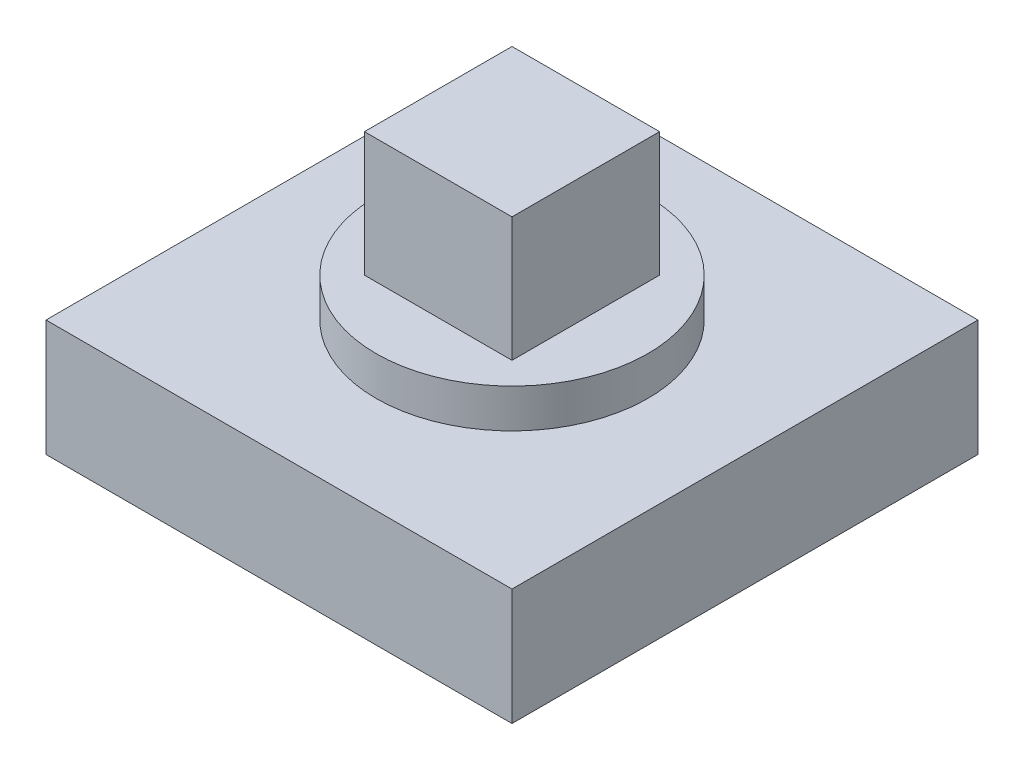
ISO-10303-21;
HEADER;
FILE_DESCRIPTION(('STEP AP214'),'2;1');
FILE_NAME('part.step','',(''),(''),'','','');
FILE_SCHEMA(('AUTOMOTIVE_DESIGN { 1 0 10303 214 1 1 1 1 }'));
ENDSEC;
DATA;
#1=APPLICATION_CONTEXT('core data for automotive mechanical design processes');
#2=APPLICATION_PROTOCOL_DEFINITION('international standard','automotive_design',2000,#1);
#3=PRODUCT_CONTEXT('',#1,'mechanical');
#4=PRODUCT('Part','Part','',(#3));
#5=PRODUCT_RELATED_PRODUCT_CATEGORY('part','',(#4));
#6=PRODUCT_DEFINITION_FORMATION('','',#4);
#7=PRODUCT_DEFINITION_CONTEXT('part definition',#1,'design');
#8=PRODUCT_DEFINITION('design','',#6,#7);
#9=PRODUCT_DEFINITION_SHAPE('','',#8);
#10=(LENGTH_UNIT() NAMED_UNIT(*) SI_UNIT(.MILLI.,.METRE.));
#11=(NAMED_UNIT(*) PLANE_ANGLE_UNIT() SI_UNIT($,.RADIAN.));
#12=(NAMED_UNIT(*) SI_UNIT($,.STERADIAN.) SOLID_ANGLE_UNIT());
#13=UNCERTAINTY_MEASURE_WITH_UNIT(LENGTH_MEASURE(1.E-05),#10,'distance_accuracy_value','');
#14=(GEOMETRIC_REPRESENTATION_CONTEXT(3) GLOBAL_UNCERTAINTY_ASSIGNED_CONTEXT((#13)) GLOBAL_UNIT_ASSIGNED_CONTEXT((#10,
#11,#12)) REPRESENTATION_CONTEXT('',''));
#15=CARTESIAN_POINT('',(0.,0.,0.));
#16=DIRECTION('',(0.,0.,1.));
#17=DIRECTION('',(1.,0.,0.));
#18=AXIS2_PLACEMENT_3D('',#15,#16,#17);
#19=CARTESIAN_POINT('',(-6.,3.,6.));
#20=DIRECTION('',(1.,0.,0.));
#21=DIRECTION('',(0.,0.,-1.));
#22=AXIS2_PLACEMENT_3D('',#19,#20,#21);
#23=PLANE('',#22);
#24=DIRECTION('',(0.,0.,1.));
#25=VECTOR('',#24,1.);
#26=CARTESIAN_POINT('',(-6.,0.,6.));
#27=LINE('',#26,#25);
#28=CARTESIAN_POINT('',(-6.,0.,-6.));
#29=VERTEX_POINT('',#28);
#30=CARTESIAN_POINT('',(-6.,0.,6.));
#31=VERTEX_POINT('',#30);
#32=EDGE_CURVE('E133',#29,#31,#27,.T.);
#33=ORIENTED_EDGE('',*,*,#32,.T.);
#34=DIRECTION('',(0.,-1.,0.));
#35=VECTOR('',#34,1.);
#36=CARTESIAN_POINT('',(-6.,3.,6.));
#37=LINE('',#36,#35);
#38=CARTESIAN_POINT('',(-6.,3.,6.));
#39=VERTEX_POINT('',#38);
#40=EDGE_CURVE('E42',#39,#31,#37,.T.);
#41=ORIENTED_EDGE('',*,*,#40,.F.);
#42=DIRECTION('',(0.,0.,1.));
#43=VECTOR('',#42,1.);
#44=CARTESIAN_POINT('',(-6.,3.,6.));
#45=LINE('',#44,#43);
#46=CARTESIAN_POINT('',(-6.,3.,-6.));
#47=VERTEX_POINT('',#46);
#48=EDGE_CURVE('E139',#47,#39,#45,.T.);
#49=ORIENTED_EDGE('',*,*,#48,.F.);
#50=DIRECTION('',(0.,-1.,0.));
#51=VECTOR('',#50,1.);
#52=CARTESIAN_POINT('',(-6.,3.,-6.));
#53=LINE('',#52,#51);
#54=EDGE_CURVE('E153',#47,#29,#53,.T.);
#55=ORIENTED_EDGE('',*,*,#54,.T.);
#56=EDGE_LOOP('',(#33,#41,#49,#55));
#57=FACE_BOUND('',#56,.T.);
#58=ADVANCED_FACE('F39',(#57),#23,.F.);
#59=CARTESIAN_POINT('',(-6.,3.,6.));
#60=DIRECTION('',(0.,0.,-1.));
#61=DIRECTION('',(-1.,0.,0.));
#62=AXIS2_PLACEMENT_3D('',#59,#60,#61);
#63=PLANE('',#62);
#64=DIRECTION('',(1.,0.,0.));
#65=VECTOR('',#64,1.);
#66=CARTESIAN_POINT('',(-6.,0.,6.));
#67=LINE('',#66,#65);
#68=CARTESIAN_POINT('',(6.,0.,6.));
#69=VERTEX_POINT('',#68);
#70=EDGE_CURVE('E157',#31,#69,#67,.T.);
#71=ORIENTED_EDGE('',*,*,#70,.T.);
#72=DIRECTION('',(0.,-1.,0.));
#73=VECTOR('',#72,1.);
#74=CARTESIAN_POINT('',(6.,3.,6.));
#75=LINE('',#74,#73);
#76=CARTESIAN_POINT('',(6.,3.,6.));
#77=VERTEX_POINT('',#76);
#78=EDGE_CURVE('E171',#77,#69,#75,.T.);
#79=ORIENTED_EDGE('',*,*,#78,.F.);
#80=DIRECTION('',(1.,0.,0.));
#81=VECTOR('',#80,1.);
#82=CARTESIAN_POINT('',(-6.,3.,6.));
#83=LINE('',#82,#81);
#84=EDGE_CURVE('E143',#39,#77,#83,.T.);
#85=ORIENTED_EDGE('',*,*,#84,.F.);
#86=ORIENTED_EDGE('',*,*,#40,.T.);
#87=EDGE_LOOP('',(#71,#79,#85,#86));
#88=FACE_BOUND('',#87,.T.);
#89=ADVANCED_FACE('F182',(#88),#63,.F.);
#90=CARTESIAN_POINT('',(6.,3.,6.));
#91=DIRECTION('',(-1.,0.,0.));
#92=DIRECTION('',(0.,0.,1.));
#93=AXIS2_PLACEMENT_3D('',#90,#91,#92);
#94=PLANE('',#93);
#95=DIRECTION('',(0.,0.,-1.));
#96=VECTOR('',#95,1.);
#97=CARTESIAN_POINT('',(6.,0.,6.));
#98=LINE('',#97,#96);
#99=CARTESIAN_POINT('',(6.,0.,-6.));
#100=VERTEX_POINT('',#99);
#101=EDGE_CURVE('E160',#69,#100,#98,.T.);
#102=ORIENTED_EDGE('',*,*,#101,.T.);
#103=DIRECTION('',(0.,-1.,0.));
#104=VECTOR('',#103,1.);
#105=CARTESIAN_POINT('',(6.,3.,-6.));
#106=LINE('',#105,#104);
#107=CARTESIAN_POINT('',(6.,3.,-6.));
#108=VERTEX_POINT('',#107);
#109=EDGE_CURVE('E168',#108,#100,#106,.T.);
#110=ORIENTED_EDGE('',*,*,#109,.F.);
#111=DIRECTION('',(0.,0.,-1.));
#112=VECTOR('',#111,1.);
#113=CARTESIAN_POINT('',(6.,3.,6.));
#114=LINE('',#113,#112);
#115=EDGE_CURVE('E147',#77,#108,#114,.T.);
#116=ORIENTED_EDGE('',*,*,#115,.F.);
#117=ORIENTED_EDGE('',*,*,#78,.T.);
#118=EDGE_LOOP('',(#102,#110,#116,#117));
#119=FACE_BOUND('',#118,.T.);
#120=ADVANCED_FACE('F191',(#119),#94,.F.);
#121=CARTESIAN_POINT('',(-6.,3.,-6.));
#122=DIRECTION('',(0.,0.,1.));
#123=DIRECTION('',(1.,0.,0.));
#124=AXIS2_PLACEMENT_3D('',#121,#122,#123);
#125=PLANE('',#124);
#126=DIRECTION('',(-1.,0.,0.));
#127=VECTOR('',#126,1.);
#128=CARTESIAN_POINT('',(-6.,0.,-6.));
#129=LINE('',#128,#127);
#130=EDGE_CURVE('E144',#100,#29,#129,.T.);
#131=ORIENTED_EDGE('',*,*,#130,.T.);
#132=ORIENTED_EDGE('',*,*,#54,.F.);
#133=DIRECTION('',(-1.,0.,0.));
#134=VECTOR('',#133,1.);
#135=CARTESIAN_POINT('',(-6.,3.,-6.));
#136=LINE('',#135,#134);
#137=EDGE_CURVE('E150',#108,#47,#136,.T.);
#138=ORIENTED_EDGE('',*,*,#137,.F.);
#139=ORIENTED_EDGE('',*,*,#109,.T.);
#140=EDGE_LOOP('',(#131,#132,#138,#139));
#141=FACE_BOUND('',#140,.T.);
#142=ADVANCED_FACE('F194',(#141),#125,.F.);
#143=CARTESIAN_POINT('',(0.,3.,0.));
#144=DIRECTION('',(0.,-1.,0.));
#145=DIRECTION('',(0.,0.,-1.));
#146=AXIS2_PLACEMENT_3D('',#143,#144,#145);
#147=PLANE('',#146);
#148=CARTESIAN_POINT('',(0.,3.,0.));
#149=DIRECTION('',(0.,1.,0.));
#150=DIRECTION('',(0.,0.,1.));
#151=AXIS2_PLACEMENT_3D('',#148,#149,#150);
#152=CIRCLE('',#151,3.5);
#153=CARTESIAN_POINT('',(0.,3.,3.5));
#154=VERTEX_POINT('',#153);
#155=EDGE_CURVE('E11',#154,#154,#152,.T.);
#156=ORIENTED_EDGE('',*,*,#155,.F.);
#157=EDGE_LOOP('',(#156));
#158=FACE_BOUND('',#157,.T.);
#159=ORIENTED_EDGE('',*,*,#48,.T.);
#160=ORIENTED_EDGE('',*,*,#84,.T.);
#161=ORIENTED_EDGE('',*,*,#115,.T.);
#162=ORIENTED_EDGE('',*,*,#137,.T.);
#163=EDGE_LOOP('',(#159,#160,#161,#162));
#164=FACE_BOUND('',#163,.T.);
#165=ADVANCED_FACE('F196',(#158,#164),#147,.F.);
#166=CARTESIAN_POINT('',(0.,0.,0.));
#167=DIRECTION('',(0.,-1.,0.));
#168=DIRECTION('',(0.,0.,-1.));
#169=AXIS2_PLACEMENT_3D('',#166,#167,#168);
#170=PLANE('',#169);
#171=ORIENTED_EDGE('',*,*,#32,.F.);
#172=ORIENTED_EDGE('',*,*,#130,.F.);
#173=ORIENTED_EDGE('',*,*,#101,.F.);
#174=ORIENTED_EDGE('',*,*,#70,.F.);
#175=EDGE_LOOP('',(#171,#172,#173,#174));
#176=FACE_BOUND('',#175,.T.);
#177=ADVANCED_FACE('F189',(#176),#170,.T.);
#178=CARTESIAN_POINT('',(0.,4.,0.));
#179=DIRECTION('',(0.,-1.,0.));
#180=DIRECTION('',(0.,0.,-1.));
#181=AXIS2_PLACEMENT_3D('',#178,#179,#180);
#182=CYLINDRICAL_SURFACE('',#181,3.5);
#183=CARTESIAN_POINT('',(0.,4.,0.));
#184=DIRECTION('',(0.,1.,0.));
#185=DIRECTION('',(0.,0.,1.));
#186=AXIS2_PLACEMENT_3D('',#183,#184,#185);
#187=CIRCLE('',#186,3.5);
#188=CARTESIAN_POINT('',(0.,4.,3.5));
#189=VERTEX_POINT('',#188);
#190=EDGE_CURVE('E128',#189,#189,#187,.T.);
#191=ORIENTED_EDGE('',*,*,#190,.F.);
#192=EDGE_LOOP('',(#191));
#193=FACE_BOUND('',#192,.T.);
#194=ORIENTED_EDGE('',*,*,#155,.T.);
#195=EDGE_LOOP('',(#194));
#196=FACE_BOUND('',#195,.T.);
#197=ADVANCED_FACE('F204',(#193,#196),#182,.T.);
#198=CARTESIAN_POINT('',(0.,4.,0.));
#199=DIRECTION('',(0.,1.,0.));
#200=DIRECTION('',(0.,0.,1.));
#201=AXIS2_PLACEMENT_3D('',#198,#199,#200);
#202=PLANE('',#201);
#203=DIRECTION('',(0.,0.,1.));
#204=VECTOR('',#203,1.);
#205=CARTESIAN_POINT('',(-1.9,4.,-1.9));
#206=LINE('',#205,#204);
#207=CARTESIAN_POINT('',(-1.9,4.,-1.9));
#208=VERTEX_POINT('',#207);
#209=CARTESIAN_POINT('',(-1.9,4.,1.9));
#210=VERTEX_POINT('',#209);
#211=EDGE_CURVE('E55',#208,#210,#206,.T.);
#212=ORIENTED_EDGE('',*,*,#211,.F.);
#213=DIRECTION('',(-1.,0.,0.));
#214=VECTOR('',#213,1.);
#215=CARTESIAN_POINT('',(-1.9,4.,-1.9));
#216=LINE('',#215,#214);
#217=CARTESIAN_POINT('',(1.9,4.,-1.9));
#218=VERTEX_POINT('',#217);
#219=EDGE_CURVE('E59',#218,#208,#216,.T.);
#220=ORIENTED_EDGE('',*,*,#219,.F.);
#221=DIRECTION('',(0.,0.,-1.));
#222=VECTOR('',#221,1.);
#223=CARTESIAN_POINT('',(1.9,4.,-1.9));
#224=LINE('',#223,#222);
#225=CARTESIAN_POINT('',(1.9,4.,1.9));
#226=VERTEX_POINT('',#225);
#227=EDGE_CURVE('E302',#226,#218,#224,.T.);
#228=ORIENTED_EDGE('',*,*,#227,.F.);
#229=DIRECTION('',(1.,0.,0.));
#230=VECTOR('',#229,1.);
#231=CARTESIAN_POINT('',(-1.9,4.,1.9));
#232=LINE('',#231,#230);
#233=EDGE_CURVE('E312',#210,#226,#232,.T.);
#234=ORIENTED_EDGE('',*,*,#233,.F.);
#235=EDGE_LOOP('',(#212,#220,#228,#234));
#236=FACE_BOUND('',#235,.T.);
#237=ORIENTED_EDGE('',*,*,#190,.T.);
#238=EDGE_LOOP('',(#237));
#239=FACE_BOUND('',#238,.T.);
#240=ADVANCED_FACE('F242',(#236,#239),#202,.T.);
#241=CARTESIAN_POINT('',(-1.9,7.2,-1.9));
#242=DIRECTION('',(1.,0.,0.));
#243=DIRECTION('',(0.,0.,-1.));
#244=AXIS2_PLACEMENT_3D('',#241,#242,#243);
#245=PLANE('',#244);
#246=ORIENTED_EDGE('',*,*,#211,.T.);
#247=DIRECTION('',(0.,-1.,0.));
#248=VECTOR('',#247,1.);
#249=CARTESIAN_POINT('',(-1.9,7.2,1.9));
#250=LINE('',#249,#248);
#251=CARTESIAN_POINT('',(-1.9,7.2,1.9));
#252=VERTEX_POINT('',#251);
#253=EDGE_CURVE('E108',#252,#210,#250,.T.);
#254=ORIENTED_EDGE('',*,*,#253,.F.);
#255=DIRECTION('',(0.,0.,1.));
#256=VECTOR('',#255,1.);
#257=CARTESIAN_POINT('',(-1.9,7.2,-1.9));
#258=LINE('',#257,#256);
#259=CARTESIAN_POINT('',(-1.9,7.2,-1.9));
#260=VERTEX_POINT('',#259);
#261=EDGE_CURVE('E115',#260,#252,#258,.T.);
#262=ORIENTED_EDGE('',*,*,#261,.F.);
#263=DIRECTION('',(0.,-1.,0.));
#264=VECTOR('',#263,1.);
#265=CARTESIAN_POINT('',(-1.9,7.2,-1.9));
#266=LINE('',#265,#264);
#267=EDGE_CURVE('E299',#260,#208,#266,.T.);
#268=ORIENTED_EDGE('',*,*,#267,.T.);
#269=EDGE_LOOP('',(#246,#254,#262,#268));
#270=FACE_BOUND('',#269,.T.);
#271=ADVANCED_FACE('F126',(#270),#245,.F.);
#272=CARTESIAN_POINT('',(-1.9,7.2,1.9));
#273=DIRECTION('',(0.,0.,-1.));
#274=DIRECTION('',(-1.,0.,0.));
#275=AXIS2_PLACEMENT_3D('',#272,#273,#274);
#276=PLANE('',#275);
#277=ORIENTED_EDGE('',*,*,#233,.T.);
#278=DIRECTION('',(0.,-1.,0.));
#279=VECTOR('',#278,1.);
#280=CARTESIAN_POINT('',(1.9,7.2,1.9));
#281=LINE('',#280,#279);
#282=CARTESIAN_POINT('',(1.9,7.2,1.9));
#283=VERTEX_POINT('',#282);
#284=EDGE_CURVE('E110',#283,#226,#281,.T.);
#285=ORIENTED_EDGE('',*,*,#284,.F.);
#286=DIRECTION('',(1.,0.,0.));
#287=VECTOR('',#286,1.);
#288=CARTESIAN_POINT('',(-1.9,7.2,1.9));
#289=LINE('',#288,#287);
#290=EDGE_CURVE('E103',#252,#283,#289,.T.);
#291=ORIENTED_EDGE('',*,*,#290,.F.);
#292=ORIENTED_EDGE('',*,*,#253,.T.);
#293=EDGE_LOOP('',(#277,#285,#291,#292));
#294=FACE_BOUND('',#293,.T.);
#295=ADVANCED_FACE('F106',(#294),#276,.F.);
#296=CARTESIAN_POINT('',(1.9,7.2,-1.9));
#297=DIRECTION('',(-1.,0.,0.));
#298=DIRECTION('',(0.,0.,1.));
#299=AXIS2_PLACEMENT_3D('',#296,#297,#298);
#300=PLANE('',#299);
#301=ORIENTED_EDGE('',*,*,#227,.T.);
#302=DIRECTION('',(0.,-1.,0.));
#303=VECTOR('',#302,1.);
#304=CARTESIAN_POINT('',(1.9,7.2,-1.9));
#305=LINE('',#304,#303);
#306=CARTESIAN_POINT('',(1.9,7.2,-1.9));
#307=VERTEX_POINT('',#306);
#308=EDGE_CURVE('E135',#307,#218,#305,.T.);
#309=ORIENTED_EDGE('',*,*,#308,.F.);
#310=DIRECTION('',(0.,0.,-1.));
#311=VECTOR('',#310,1.);
#312=CARTESIAN_POINT('',(1.9,7.2,-1.9));
#313=LINE('',#312,#311);
#314=EDGE_CURVE('E114',#283,#307,#313,.T.);
#315=ORIENTED_EDGE('',*,*,#314,.F.);
#316=ORIENTED_EDGE('',*,*,#284,.T.);
#317=EDGE_LOOP('',(#301,#309,#315,#316));
#318=FACE_BOUND('',#317,.T.);
#319=ADVANCED_FACE('F267',(#318),#300,.F.);
#320=CARTESIAN_POINT('',(-1.9,7.2,-1.9));
#321=DIRECTION('',(0.,0.,1.));
#322=DIRECTION('',(1.,0.,0.));
#323=AXIS2_PLACEMENT_3D('',#320,#321,#322);
#324=PLANE('',#323);
#325=ORIENTED_EDGE('',*,*,#219,.T.);
#326=ORIENTED_EDGE('',*,*,#267,.F.);
#327=DIRECTION('',(-1.,0.,0.));
#328=VECTOR('',#327,1.);
#329=CARTESIAN_POINT('',(-1.9,7.2,-1.9));
#330=LINE('',#329,#328);
#331=EDGE_CURVE('E120',#307,#260,#330,.T.);
#332=ORIENTED_EDGE('',*,*,#331,.F.);
#333=ORIENTED_EDGE('',*,*,#308,.T.);
#334=EDGE_LOOP('',(#325,#326,#332,#333));
#335=FACE_BOUND('',#334,.T.);
#336=ADVANCED_FACE('F276',(#335),#324,.F.);
#337=CARTESIAN_POINT('',(0.,7.2,0.));
#338=DIRECTION('',(0.,1.,0.));
#339=DIRECTION('',(0.,0.,1.));
#340=AXIS2_PLACEMENT_3D('',#337,#338,#339);
#341=PLANE('',#340);
#342=ORIENTED_EDGE('',*,*,#261,.T.);
#343=ORIENTED_EDGE('',*,*,#290,.T.);
#344=ORIENTED_EDGE('',*,*,#314,.T.);
#345=ORIENTED_EDGE('',*,*,#331,.T.);
#346=EDGE_LOOP('',(#342,#343,#344,#345));
#347=FACE_BOUND('',#346,.T.);
#348=ADVANCED_FACE('F118',(#347),#341,.T.);
#349=CLOSED_SHELL('',(#58,#89,#120,#142,#165,#177,#197,#240,#271,#295,#319,#336,#348));
#350=MANIFOLD_SOLID_BREP('B2',#349);
#351=ADVANCED_BREP_SHAPE_REPRESENTATION('',(#18,#350),#14);
#352=SHAPE_DEFINITION_REPRESENTATION(#9,#351);
ENDSEC;
END-ISO-10303-21;
